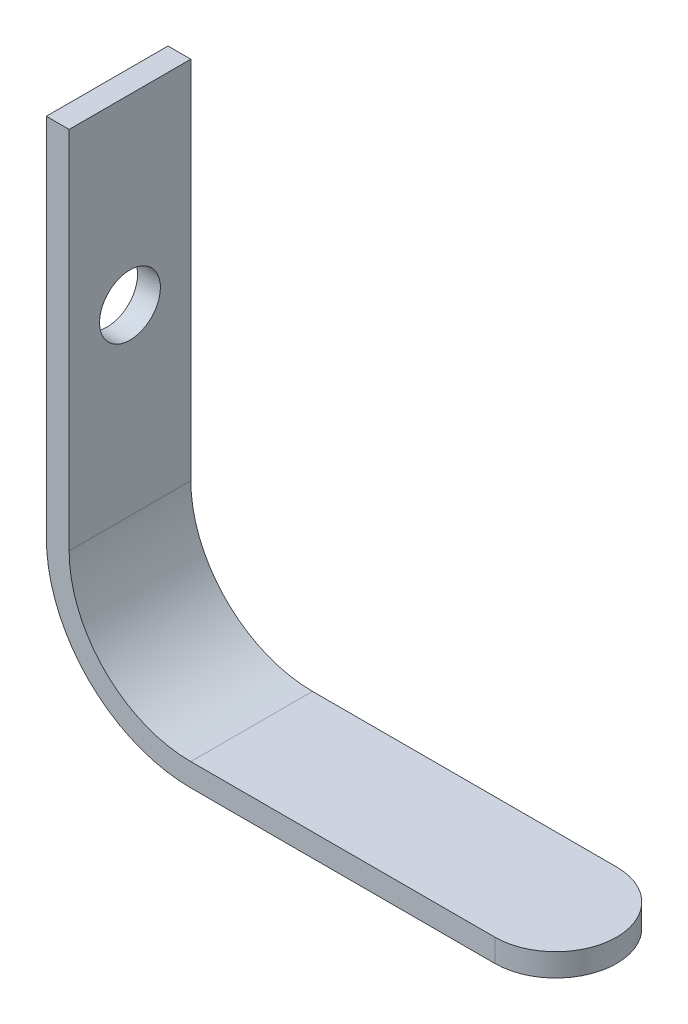
ISO-10303-21;
HEADER;
FILE_DESCRIPTION(('STEP AP214'),'2;1');
FILE_NAME('part.step','',(''),(''),'','','');
FILE_SCHEMA(('AUTOMOTIVE_DESIGN { 1 0 10303 214 1 1 1 1 }'));
ENDSEC;
DATA;
#1=APPLICATION_CONTEXT('core data for automotive mechanical design processes');
#2=APPLICATION_PROTOCOL_DEFINITION('international standard','automotive_design',2000,#1);
#3=PRODUCT_CONTEXT('',#1,'mechanical');
#4=PRODUCT('Part','Part','',(#3));
#5=PRODUCT_RELATED_PRODUCT_CATEGORY('part','',(#4));
#6=PRODUCT_DEFINITION_FORMATION('','',#4);
#7=PRODUCT_DEFINITION_CONTEXT('part definition',#1,'design');
#8=PRODUCT_DEFINITION('design','',#6,#7);
#9=PRODUCT_DEFINITION_SHAPE('','',#8);
#10=(LENGTH_UNIT() NAMED_UNIT(*) SI_UNIT(.MILLI.,.METRE.));
#11=(NAMED_UNIT(*) PLANE_ANGLE_UNIT() SI_UNIT($,.RADIAN.));
#12=(NAMED_UNIT(*) SI_UNIT($,.STERADIAN.) SOLID_ANGLE_UNIT());
#13=UNCERTAINTY_MEASURE_WITH_UNIT(LENGTH_MEASURE(1.E-05),#10,'distance_accuracy_value','');
#14=(GEOMETRIC_REPRESENTATION_CONTEXT(3) GLOBAL_UNCERTAINTY_ASSIGNED_CONTEXT((#13)) GLOBAL_UNIT_ASSIGNED_CONTEXT((#10,
#11,#12)) REPRESENTATION_CONTEXT('',''));
#15=CARTESIAN_POINT('',(0.,0.,0.));
#16=DIRECTION('',(0.,0.,1.));
#17=DIRECTION('',(1.,0.,0.));
#18=AXIS2_PLACEMENT_3D('',#15,#16,#17);
#19=CARTESIAN_POINT('',(25.4000000000003,-4.76250000000014,12.7));
#20=DIRECTION('',(0.,1.,0.));
#21=DIRECTION('',(0.,0.,1.));
#22=AXIS2_PLACEMENT_3D('',#19,#20,#21);
#23=PLANE('',#22);
#24=CARTESIAN_POINT('',(88.9,-4.76250000000028,0.));
#25=DIRECTION('',(0.,1.,0.));
#26=DIRECTION('',(0.,0.,1.));
#27=AXIS2_PLACEMENT_3D('',#24,#25,#26);
#28=CIRCLE('',#27,12.7);
#29=CARTESIAN_POINT('',(88.9,-4.76250000000014,12.7));
#30=VERTEX_POINT('',#29);
#31=CARTESIAN_POINT('',(88.9,-4.7625,-12.7000000000001));
#32=VERTEX_POINT('',#31);
#33=EDGE_CURVE('E38',#30,#32,#28,.T.);
#34=ORIENTED_EDGE('',*,*,#33,.F.);
#35=DIRECTION('',(1.,0.,0.));
#36=VECTOR('',#35,1.);
#37=CARTESIAN_POINT('',(25.4000000000003,-4.76250000000014,12.7));
#38=LINE('',#37,#36);
#39=CARTESIAN_POINT('',(25.4000000000003,-4.76250000000014,12.7));
#40=VERTEX_POINT('',#39);
#41=EDGE_CURVE('E103',#40,#30,#38,.T.);
#42=ORIENTED_EDGE('',*,*,#41,.F.);
#43=DIRECTION('',(0.,0.,-1.));
#44=VECTOR('',#43,1.);
#45=CARTESIAN_POINT('',(25.4000000000003,-4.76250000000014,12.7));
#46=LINE('',#45,#44);
#47=CARTESIAN_POINT('',(25.4000000000003,-4.76250000000013,-12.7000000000001));
#48=VERTEX_POINT('',#47);
#49=EDGE_CURVE('E123',#40,#48,#46,.T.);
#50=ORIENTED_EDGE('',*,*,#49,.T.);
#51=DIRECTION('',(1.,0.,0.));
#52=VECTOR('',#51,1.);
#53=CARTESIAN_POINT('',(25.4000000000003,-4.76250000000013,-12.7000000000001));
#54=LINE('',#53,#52);
#55=EDGE_CURVE('E95',#48,#32,#54,.T.);
#56=ORIENTED_EDGE('',*,*,#55,.T.);
#57=EDGE_LOOP('',(#34,#42,#50,#56));
#58=FACE_BOUND('',#57,.T.);
#59=ADVANCED_FACE('F24',(#58),#23,.F.);
#60=CARTESIAN_POINT('',(25.4,-1.38777878078145E-13,12.7));
#61=DIRECTION('',(0.,1.,0.));
#62=DIRECTION('',(0.,0.,1.));
#63=AXIS2_PLACEMENT_3D('',#60,#61,#62);
#64=PLANE('',#63);
#65=DIRECTION('',(1.,0.,0.));
#66=VECTOR('',#65,1.);
#67=CARTESIAN_POINT('',(25.4,-1.38777878078145E-13,12.7));
#68=LINE('',#67,#66);
#69=CARTESIAN_POINT('',(25.4,-1.38777878078145E-13,12.7));
#70=VERTEX_POINT('',#69);
#71=CARTESIAN_POINT('',(88.8999999999999,-1.38777878078145E-13,12.7));
#72=VERTEX_POINT('',#71);
#73=EDGE_CURVE('E100',#70,#72,#68,.T.);
#74=ORIENTED_EDGE('',*,*,#73,.T.);
#75=CARTESIAN_POINT('',(88.9,-2.77555756156289E-13,0.));
#76=DIRECTION('',(0.,-1.,0.));
#77=DIRECTION('',(0.,0.,-1.));
#78=AXIS2_PLACEMENT_3D('',#75,#76,#77);
#79=CIRCLE('',#78,12.7);
#80=CARTESIAN_POINT('',(88.9,0.,-12.7000000000001));
#81=VERTEX_POINT('',#80);
#82=EDGE_CURVE('E86',#81,#72,#79,.T.);
#83=ORIENTED_EDGE('',*,*,#82,.F.);
#84=DIRECTION('',(1.,0.,0.));
#85=VECTOR('',#84,1.);
#86=CARTESIAN_POINT('',(25.4,-1.38777878078145E-13,-12.7));
#87=LINE('',#86,#85);
#88=CARTESIAN_POINT('',(25.4,-1.38777878078145E-13,-12.7));
#89=VERTEX_POINT('',#88);
#90=EDGE_CURVE('E148',#89,#81,#87,.T.);
#91=ORIENTED_EDGE('',*,*,#90,.F.);
#92=DIRECTION('',(0.,0.,-1.));
#93=VECTOR('',#92,1.);
#94=CARTESIAN_POINT('',(25.4,-1.38777878078145E-13,12.7));
#95=LINE('',#94,#93);
#96=EDGE_CURVE('E11',#70,#89,#95,.T.);
#97=ORIENTED_EDGE('',*,*,#96,.F.);
#98=EDGE_LOOP('',(#74,#83,#91,#97));
#99=FACE_BOUND('',#98,.T.);
#100=ADVANCED_FACE('F106',(#99),#64,.T.);
#101=CARTESIAN_POINT('',(25.4,25.3999999999999,12.7));
#102=DIRECTION('',(0.,0.,-1.));
#103=DIRECTION('',(-1.,0.,0.));
#104=AXIS2_PLACEMENT_3D('',#101,#102,#103);
#105=CYLINDRICAL_SURFACE('',#104,25.4);
#106=ORIENTED_EDGE('',*,*,#96,.T.);
#107=CARTESIAN_POINT('',(25.4,25.3999999999999,-12.7000000000001));
#108=DIRECTION('',(0.,0.,1.));
#109=DIRECTION('',(1.,0.,0.));
#110=AXIS2_PLACEMENT_3D('',#107,#108,#109);
#111=CIRCLE('',#110,25.4);
#112=CARTESIAN_POINT('',(0.,25.4,-12.7));
#113=VERTEX_POINT('',#112);
#114=EDGE_CURVE('E142',#113,#89,#111,.T.);
#115=ORIENTED_EDGE('',*,*,#114,.F.);
#116=DIRECTION('',(0.,0.,-1.));
#117=VECTOR('',#116,1.);
#118=CARTESIAN_POINT('',(0.,25.4,12.7000000000001));
#119=LINE('',#118,#117);
#120=CARTESIAN_POINT('',(0.,25.4,12.7000000000001));
#121=VERTEX_POINT('',#120);
#122=EDGE_CURVE('E31',#121,#113,#119,.T.);
#123=ORIENTED_EDGE('',*,*,#122,.F.);
#124=CARTESIAN_POINT('',(25.4,25.3999999999999,12.7));
#125=DIRECTION('',(0.,0.,1.));
#126=DIRECTION('',(1.,0.,0.));
#127=AXIS2_PLACEMENT_3D('',#124,#125,#126);
#128=CIRCLE('',#127,25.4);
#129=EDGE_CURVE('E107',#121,#70,#128,.T.);
#130=ORIENTED_EDGE('',*,*,#129,.T.);
#131=EDGE_LOOP('',(#106,#115,#123,#130));
#132=FACE_BOUND('',#131,.T.);
#133=ADVANCED_FACE('F147',(#132),#105,.F.);
#134=CARTESIAN_POINT('',(2.77555756156289E-13,101.6,12.7));
#135=DIRECTION('',(1.,0.,0.));
#136=DIRECTION('',(0.,1.,0.));
#137=AXIS2_PLACEMENT_3D('',#134,#135,#136);
#138=PLANE('',#137);
#139=CARTESIAN_POINT('',(0.,63.5000000000002,0.));
#140=DIRECTION('',(1.,0.,0.));
#141=DIRECTION('',(0.,1.,0.));
#142=AXIS2_PLACEMENT_3D('',#139,#140,#141);
#143=CIRCLE('',#142,6.35);
#144=CARTESIAN_POINT('',(0.,69.8500000000002,0.));
#145=VERTEX_POINT('',#144);
#146=EDGE_CURVE('E169',#145,#145,#143,.T.);
#147=ORIENTED_EDGE('',*,*,#146,.F.);
#148=EDGE_LOOP('',(#147));
#149=FACE_BOUND('',#148,.T.);
#150=ORIENTED_EDGE('',*,*,#122,.T.);
#151=DIRECTION('',(0.,-1.,0.));
#152=VECTOR('',#151,1.);
#153=CARTESIAN_POINT('',(2.77555756156289E-13,101.6,-12.7));
#154=LINE('',#153,#152);
#155=CARTESIAN_POINT('',(2.77555756156289E-13,101.6,-12.7));
#156=VERTEX_POINT('',#155);
#157=EDGE_CURVE('E134',#156,#113,#154,.T.);
#158=ORIENTED_EDGE('',*,*,#157,.F.);
#159=DIRECTION('',(0.,0.,-1.));
#160=VECTOR('',#159,1.);
#161=CARTESIAN_POINT('',(2.77555756156289E-13,101.6,12.7));
#162=LINE('',#161,#160);
#163=CARTESIAN_POINT('',(2.77555756156289E-13,101.6,12.7));
#164=VERTEX_POINT('',#163);
#165=EDGE_CURVE('E129',#164,#156,#162,.T.);
#166=ORIENTED_EDGE('',*,*,#165,.F.);
#167=DIRECTION('',(0.,-1.,0.));
#168=VECTOR('',#167,1.);
#169=CARTESIAN_POINT('',(2.77555756156289E-13,101.6,12.7));
#170=LINE('',#169,#168);
#171=EDGE_CURVE('E109',#164,#121,#170,.T.);
#172=ORIENTED_EDGE('',*,*,#171,.T.);
#173=EDGE_LOOP('',(#150,#158,#166,#172));
#174=FACE_BOUND('',#173,.T.);
#175=ADVANCED_FACE('F133',(#149,#174),#138,.T.);
#176=CARTESIAN_POINT('',(-4.76249999999973,101.6,12.7));
#177=DIRECTION('',(0.,1.,0.));
#178=DIRECTION('',(0.,0.,1.));
#179=AXIS2_PLACEMENT_3D('',#176,#177,#178);
#180=PLANE('',#179);
#181=ORIENTED_EDGE('',*,*,#165,.T.);
#182=DIRECTION('',(1.,0.,0.));
#183=VECTOR('',#182,1.);
#184=CARTESIAN_POINT('',(-4.76249999999973,101.6,-12.7));
#185=LINE('',#184,#183);
#186=CARTESIAN_POINT('',(-4.76249999999973,101.6,-12.7));
#187=VERTEX_POINT('',#186);
#188=EDGE_CURVE('E145',#187,#156,#185,.T.);
#189=ORIENTED_EDGE('',*,*,#188,.F.);
#190=DIRECTION('',(0.,0.,-1.));
#191=VECTOR('',#190,1.);
#192=CARTESIAN_POINT('',(-4.76249999999973,101.6,12.7));
#193=LINE('',#192,#191);
#194=CARTESIAN_POINT('',(-4.76249999999973,101.6,12.7));
#195=VERTEX_POINT('',#194);
#196=EDGE_CURVE('E127',#195,#187,#193,.T.);
#197=ORIENTED_EDGE('',*,*,#196,.F.);
#198=DIRECTION('',(1.,0.,0.));
#199=VECTOR('',#198,1.);
#200=CARTESIAN_POINT('',(-4.76249999999973,101.6,12.7));
#201=LINE('',#200,#199);
#202=EDGE_CURVE('E117',#195,#164,#201,.T.);
#203=ORIENTED_EDGE('',*,*,#202,.T.);
#204=EDGE_LOOP('',(#181,#189,#197,#203));
#205=FACE_BOUND('',#204,.T.);
#206=ADVANCED_FACE('F177',(#205),#180,.T.);
#207=CARTESIAN_POINT('',(-4.76249999999973,101.6,12.7));
#208=DIRECTION('',(1.,0.,0.));
#209=DIRECTION('',(0.,1.,0.));
#210=AXIS2_PLACEMENT_3D('',#207,#208,#209);
#211=PLANE('',#210);
#212=CARTESIAN_POINT('',(-4.76249999999975,63.5000000000002,0.));
#213=DIRECTION('',(1.,0.,0.));
#214=DIRECTION('',(0.,1.,0.));
#215=AXIS2_PLACEMENT_3D('',#212,#213,#214);
#216=CIRCLE('',#215,6.35);
#217=CARTESIAN_POINT('',(-4.76249999999975,69.8500000000002,0.));
#218=VERTEX_POINT('',#217);
#219=EDGE_CURVE('E104',#218,#218,#216,.F.);
#220=ORIENTED_EDGE('',*,*,#219,.F.);
#221=EDGE_LOOP('',(#220));
#222=FACE_BOUND('',#221,.T.);
#223=ORIENTED_EDGE('',*,*,#196,.T.);
#224=DIRECTION('',(0.,-1.,0.));
#225=VECTOR('',#224,1.);
#226=CARTESIAN_POINT('',(-4.76249999999973,101.6,-12.7));
#227=LINE('',#226,#225);
#228=CARTESIAN_POINT('',(-4.76249999999999,25.4,-12.7000000000001));
#229=VERTEX_POINT('',#228);
#230=EDGE_CURVE('E154',#187,#229,#227,.T.);
#231=ORIENTED_EDGE('',*,*,#230,.T.);
#232=DIRECTION('',(0.,0.,-1.));
#233=VECTOR('',#232,1.);
#234=CARTESIAN_POINT('',(-4.76249999999999,25.3999999999999,12.7));
#235=LINE('',#234,#233);
#236=CARTESIAN_POINT('',(-4.76249999999999,25.3999999999999,12.7));
#237=VERTEX_POINT('',#236);
#238=EDGE_CURVE('E125',#237,#229,#235,.T.);
#239=ORIENTED_EDGE('',*,*,#238,.F.);
#240=DIRECTION('',(0.,-1.,0.));
#241=VECTOR('',#240,1.);
#242=CARTESIAN_POINT('',(-4.76249999999973,101.6,12.7));
#243=LINE('',#242,#241);
#244=EDGE_CURVE('E120',#195,#237,#243,.T.);
#245=ORIENTED_EDGE('',*,*,#244,.F.);
#246=EDGE_LOOP('',(#223,#231,#239,#245));
#247=FACE_BOUND('',#246,.T.);
#248=ADVANCED_FACE('F183',(#222,#247),#211,.F.);
#249=CARTESIAN_POINT('',(25.4,25.3999999999999,12.7));
#250=DIRECTION('',(0.,0.,-1.));
#251=DIRECTION('',(-1.,0.,0.));
#252=AXIS2_PLACEMENT_3D('',#249,#250,#251);
#253=CYLINDRICAL_SURFACE('',#252,30.1625);
#254=ORIENTED_EDGE('',*,*,#238,.T.);
#255=CARTESIAN_POINT('',(25.4,25.3999999999999,-12.7000000000001));
#256=DIRECTION('',(0.,0.,1.));
#257=DIRECTION('',(1.,0.,0.));
#258=AXIS2_PLACEMENT_3D('',#255,#256,#257);
#259=CIRCLE('',#258,30.1625);
#260=EDGE_CURVE('E111',#229,#48,#259,.T.);
#261=ORIENTED_EDGE('',*,*,#260,.T.);
#262=ORIENTED_EDGE('',*,*,#49,.F.);
#263=CARTESIAN_POINT('',(25.4,25.3999999999999,12.7));
#264=DIRECTION('',(0.,0.,1.));
#265=DIRECTION('',(1.,0.,0.));
#266=AXIS2_PLACEMENT_3D('',#263,#264,#265);
#267=CIRCLE('',#266,30.1625);
#268=EDGE_CURVE('E46',#237,#40,#267,.T.);
#269=ORIENTED_EDGE('',*,*,#268,.F.);
#270=EDGE_LOOP('',(#254,#261,#262,#269));
#271=FACE_BOUND('',#270,.T.);
#272=ADVANCED_FACE('F159',(#271),#253,.T.);
#273=CARTESIAN_POINT('',(25.4,25.3999999999999,12.7));
#274=DIRECTION('',(0.,0.,1.));
#275=DIRECTION('',(1.,0.,0.));
#276=AXIS2_PLACEMENT_3D('',#273,#274,#275);
#277=PLANE('',#276);
#278=DIRECTION('',(0.,1.,0.));
#279=VECTOR('',#278,1.);
#280=CARTESIAN_POINT('',(88.9,-4.76350000000014,12.7));
#281=LINE('',#280,#279);
#282=EDGE_CURVE('E89',#30,#72,#281,.T.);
#283=ORIENTED_EDGE('',*,*,#282,.T.);
#284=ORIENTED_EDGE('',*,*,#73,.F.);
#285=ORIENTED_EDGE('',*,*,#129,.F.);
#286=ORIENTED_EDGE('',*,*,#171,.F.);
#287=ORIENTED_EDGE('',*,*,#202,.F.);
#288=ORIENTED_EDGE('',*,*,#244,.T.);
#289=ORIENTED_EDGE('',*,*,#268,.T.);
#290=ORIENTED_EDGE('',*,*,#41,.T.);
#291=EDGE_LOOP('',(#283,#284,#285,#286,#287,#288,#289,#290));
#292=FACE_BOUND('',#291,.T.);
#293=ADVANCED_FACE('F98',(#292),#277,.T.);
#294=CARTESIAN_POINT('',(25.4,25.3999999999999,-12.7000000000001));
#295=DIRECTION('',(0.,0.,1.));
#296=DIRECTION('',(1.,0.,0.));
#297=AXIS2_PLACEMENT_3D('',#294,#295,#296);
#298=PLANE('',#297);
#299=ORIENTED_EDGE('',*,*,#90,.T.);
#300=DIRECTION('',(0.,1.,0.));
#301=VECTOR('',#300,1.);
#302=CARTESIAN_POINT('',(88.9,-4.7635,-12.7000000000001));
#303=LINE('',#302,#301);
#304=EDGE_CURVE('E90',#32,#81,#303,.T.);
#305=ORIENTED_EDGE('',*,*,#304,.F.);
#306=ORIENTED_EDGE('',*,*,#55,.F.);
#307=ORIENTED_EDGE('',*,*,#260,.F.);
#308=ORIENTED_EDGE('',*,*,#230,.F.);
#309=ORIENTED_EDGE('',*,*,#188,.T.);
#310=ORIENTED_EDGE('',*,*,#157,.T.);
#311=ORIENTED_EDGE('',*,*,#114,.T.);
#312=EDGE_LOOP('',(#299,#305,#306,#307,#308,#309,#310,#311));
#313=FACE_BOUND('',#312,.T.);
#314=ADVANCED_FACE('F141',(#313),#298,.F.);
#315=CARTESIAN_POINT('',(88.9,-4.76350000000028,0.));
#316=DIRECTION('',(0.,1.,0.));
#317=DIRECTION('',(0.,0.,1.));
#318=AXIS2_PLACEMENT_3D('',#315,#316,#317);
#319=CYLINDRICAL_SURFACE('',#318,12.7);
#320=ORIENTED_EDGE('',*,*,#33,.T.);
#321=ORIENTED_EDGE('',*,*,#304,.T.);
#322=ORIENTED_EDGE('',*,*,#82,.T.);
#323=ORIENTED_EDGE('',*,*,#282,.F.);
#324=EDGE_LOOP('',(#320,#321,#322,#323));
#325=FACE_BOUND('',#324,.T.);
#326=ADVANCED_FACE('F88',(#325),#319,.T.);
#327=CARTESIAN_POINT('',(-4.76349999999975,63.5000000000002,0.));
#328=DIRECTION('',(1.,0.,0.));
#329=DIRECTION('',(0.,1.,0.));
#330=AXIS2_PLACEMENT_3D('',#327,#328,#329);
#331=CYLINDRICAL_SURFACE('',#330,6.35);
#332=ORIENTED_EDGE('',*,*,#146,.T.);
#333=EDGE_LOOP('',(#332));
#334=FACE_BOUND('',#333,.T.);
#335=ORIENTED_EDGE('',*,*,#219,.T.);
#336=EDGE_LOOP('',(#335));
#337=FACE_BOUND('',#336,.T.);
#338=ADVANCED_FACE('F173',(#334,#337),#331,.F.);
#339=CLOSED_SHELL('',(#59,#100,#133,#175,#206,#248,#272,#293,#314,#326,#338));
#340=MANIFOLD_SOLID_BREP('B2',#339);
#341=ADVANCED_BREP_SHAPE_REPRESENTATION('',(#18,#340),#14);
#342=SHAPE_DEFINITION_REPRESENTATION(#9,#341);
ENDSEC;
END-ISO-10303-21;
